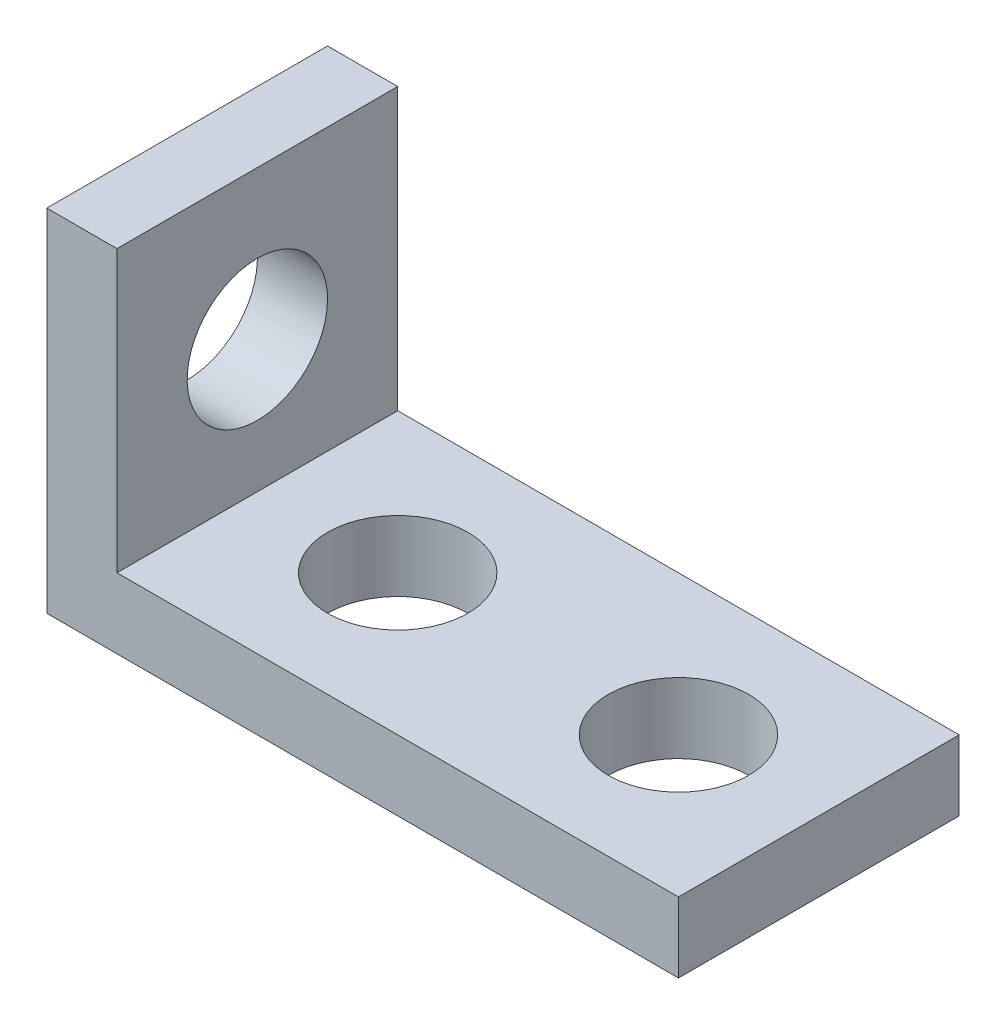
ISO-10303-21;
HEADER;
FILE_DESCRIPTION(('STEP AP214'),'2;1');
FILE_NAME('part.step','',(''),(''),'','','');
FILE_SCHEMA(('AUTOMOTIVE_DESIGN { 1 0 10303 214 1 1 1 1 }'));
ENDSEC;
DATA;
#1=APPLICATION_CONTEXT('core data for automotive mechanical design processes');
#2=APPLICATION_PROTOCOL_DEFINITION('international standard','automotive_design',2000,#1);
#3=PRODUCT_CONTEXT('',#1,'mechanical');
#4=PRODUCT('Part','Part','',(#3));
#5=PRODUCT_RELATED_PRODUCT_CATEGORY('part','',(#4));
#6=PRODUCT_DEFINITION_FORMATION('','',#4);
#7=PRODUCT_DEFINITION_CONTEXT('part definition',#1,'design');
#8=PRODUCT_DEFINITION('design','',#6,#7);
#9=PRODUCT_DEFINITION_SHAPE('','',#8);
#10=(LENGTH_UNIT() NAMED_UNIT(*) SI_UNIT(.MILLI.,.METRE.));
#11=(NAMED_UNIT(*) PLANE_ANGLE_UNIT() SI_UNIT($,.RADIAN.));
#12=(NAMED_UNIT(*) SI_UNIT($,.STERADIAN.) SOLID_ANGLE_UNIT());
#13=UNCERTAINTY_MEASURE_WITH_UNIT(LENGTH_MEASURE(1.E-05),#10,'distance_accuracy_value','');
#14=(GEOMETRIC_REPRESENTATION_CONTEXT(3) GLOBAL_UNCERTAINTY_ASSIGNED_CONTEXT((#13)) GLOBAL_UNIT_ASSIGNED_CONTEXT((#10,
#11,#12)) REPRESENTATION_CONTEXT('',''));
#15=CARTESIAN_POINT('',(0.,0.,0.));
#16=DIRECTION('',(0.,0.,1.));
#17=DIRECTION('',(1.,0.,0.));
#18=AXIS2_PLACEMENT_3D('',#15,#16,#17);
#19=CARTESIAN_POINT('',(28.575,0.,12.7));
#20=DIRECTION('',(0.,1.,0.));
#21=DIRECTION('',(-1.,0.,0.));
#22=AXIS2_PLACEMENT_3D('',#19,#20,#21);
#23=PLANE('',#22);
#24=CARTESIAN_POINT('',(22.225,0.,6.35));
#25=DIRECTION('',(0.,1.,0.));
#26=DIRECTION('',(-1.,0.,0.));
#27=AXIS2_PLACEMENT_3D('',#24,#25,#26);
#28=CIRCLE('',#27,3.175);
#29=CARTESIAN_POINT('',(19.05,0.,6.35));
#30=VERTEX_POINT('',#29);
#31=EDGE_CURVE('E164',#30,#30,#28,.T.);
#32=ORIENTED_EDGE('',*,*,#31,.T.);
#33=EDGE_LOOP('',(#32));
#34=FACE_BOUND('',#33,.T.);
#35=CARTESIAN_POINT('',(9.525,0.,6.35));
#36=DIRECTION('',(0.,1.,0.));
#37=DIRECTION('',(-1.,0.,0.));
#38=AXIS2_PLACEMENT_3D('',#35,#36,#37);
#39=CIRCLE('',#38,3.175);
#40=CARTESIAN_POINT('',(6.35,0.,6.35));
#41=VERTEX_POINT('',#40);
#42=EDGE_CURVE('E123',#41,#41,#39,.T.);
#43=ORIENTED_EDGE('',*,*,#42,.T.);
#44=EDGE_LOOP('',(#43));
#45=FACE_BOUND('',#44,.T.);
#46=DIRECTION('',(1.,0.,0.));
#47=VECTOR('',#46,1.);
#48=CARTESIAN_POINT('',(28.575,0.,0.));
#49=LINE('',#48,#47);
#50=CARTESIAN_POINT('',(0.,0.,0.));
#51=VERTEX_POINT('',#50);
#52=CARTESIAN_POINT('',(28.575,0.,0.));
#53=VERTEX_POINT('',#52);
#54=EDGE_CURVE('E119',#51,#53,#49,.T.);
#55=ORIENTED_EDGE('',*,*,#54,.T.);
#56=DIRECTION('',(0.,0.,-1.));
#57=VECTOR('',#56,1.);
#58=CARTESIAN_POINT('',(28.575,0.,12.7));
#59=LINE('',#58,#57);
#60=CARTESIAN_POINT('',(28.575,0.,12.7));
#61=VERTEX_POINT('',#60);
#62=EDGE_CURVE('E11',#61,#53,#59,.T.);
#63=ORIENTED_EDGE('',*,*,#62,.F.);
#64=DIRECTION('',(1.,0.,0.));
#65=VECTOR('',#64,1.);
#66=CARTESIAN_POINT('',(28.575,0.,12.7));
#67=LINE('',#66,#65);
#68=CARTESIAN_POINT('',(0.,0.,12.7));
#69=VERTEX_POINT('',#68);
#70=EDGE_CURVE('E130',#69,#61,#67,.T.);
#71=ORIENTED_EDGE('',*,*,#70,.F.);
#72=DIRECTION('',(0.,0.,-1.));
#73=VECTOR('',#72,1.);
#74=CARTESIAN_POINT('',(0.,0.,12.7));
#75=LINE('',#74,#73);
#76=EDGE_CURVE('E115',#69,#51,#75,.T.);
#77=ORIENTED_EDGE('',*,*,#76,.T.);
#78=EDGE_LOOP('',(#55,#63,#71,#77));
#79=FACE_BOUND('',#78,.T.);
#80=ADVANCED_FACE('F35',(#34,#45,#79),#23,.F.);
#81=CARTESIAN_POINT('',(28.575,3.175,12.7));
#82=DIRECTION('',(-1.,0.,0.));
#83=DIRECTION('',(0.,0.,1.));
#84=AXIS2_PLACEMENT_3D('',#81,#82,#83);
#85=PLANE('',#84);
#86=DIRECTION('',(0.,1.,0.));
#87=VECTOR('',#86,1.);
#88=CARTESIAN_POINT('',(28.575,3.175,0.));
#89=LINE('',#88,#87);
#90=CARTESIAN_POINT('',(28.575,3.175,0.));
#91=VERTEX_POINT('',#90);
#92=EDGE_CURVE('E122',#53,#91,#89,.T.);
#93=ORIENTED_EDGE('',*,*,#92,.T.);
#94=DIRECTION('',(0.,0.,-1.));
#95=VECTOR('',#94,1.);
#96=CARTESIAN_POINT('',(28.575,3.175,12.7));
#97=LINE('',#96,#95);
#98=CARTESIAN_POINT('',(28.575,3.175,12.7));
#99=VERTEX_POINT('',#98);
#100=EDGE_CURVE('E43',#99,#91,#97,.T.);
#101=ORIENTED_EDGE('',*,*,#100,.F.);
#102=DIRECTION('',(0.,1.,0.));
#103=VECTOR('',#102,1.);
#104=CARTESIAN_POINT('',(28.575,3.175,12.7));
#105=LINE('',#104,#103);
#106=EDGE_CURVE('E88',#61,#99,#105,.T.);
#107=ORIENTED_EDGE('',*,*,#106,.F.);
#108=ORIENTED_EDGE('',*,*,#62,.T.);
#109=EDGE_LOOP('',(#93,#101,#107,#108));
#110=FACE_BOUND('',#109,.T.);
#111=ADVANCED_FACE('F156',(#110),#85,.F.);
#112=CARTESIAN_POINT('',(3.175,3.175,12.7));
#113=DIRECTION('',(0.,-1.,0.));
#114=DIRECTION('',(1.,0.,0.));
#115=AXIS2_PLACEMENT_3D('',#112,#113,#114);
#116=PLANE('',#115);
#117=CARTESIAN_POINT('',(22.225,3.175,6.35));
#118=DIRECTION('',(0.,1.,0.));
#119=DIRECTION('',(-1.,0.,0.));
#120=AXIS2_PLACEMENT_3D('',#117,#118,#119);
#121=CIRCLE('',#120,3.175);
#122=CARTESIAN_POINT('',(19.05,3.175,6.35));
#123=VERTEX_POINT('',#122);
#124=EDGE_CURVE('E173',#123,#123,#121,.T.);
#125=ORIENTED_EDGE('',*,*,#124,.F.);
#126=EDGE_LOOP('',(#125));
#127=FACE_BOUND('',#126,.T.);
#128=CARTESIAN_POINT('',(9.525,3.175,6.35));
#129=DIRECTION('',(0.,1.,0.));
#130=DIRECTION('',(-1.,0.,0.));
#131=AXIS2_PLACEMENT_3D('',#128,#129,#130);
#132=CIRCLE('',#131,3.175);
#133=CARTESIAN_POINT('',(6.35,3.175,6.35));
#134=VERTEX_POINT('',#133);
#135=EDGE_CURVE('E168',#134,#134,#132,.T.);
#136=ORIENTED_EDGE('',*,*,#135,.F.);
#137=EDGE_LOOP('',(#136));
#138=FACE_BOUND('',#137,.T.);
#139=DIRECTION('',(-1.,0.,0.));
#140=VECTOR('',#139,1.);
#141=CARTESIAN_POINT('',(3.175,3.175,0.));
#142=LINE('',#141,#140);
#143=CARTESIAN_POINT('',(3.175,3.175,0.));
#144=VERTEX_POINT('',#143);
#145=EDGE_CURVE('E125',#91,#144,#142,.T.);
#146=ORIENTED_EDGE('',*,*,#145,.T.);
#147=DIRECTION('',(0.,0.,-1.));
#148=VECTOR('',#147,1.);
#149=CARTESIAN_POINT('',(3.175,3.175,12.7));
#150=LINE('',#149,#148);
#151=CARTESIAN_POINT('',(3.175,3.175,12.7));
#152=VERTEX_POINT('',#151);
#153=EDGE_CURVE('E110',#152,#144,#150,.T.);
#154=ORIENTED_EDGE('',*,*,#153,.F.);
#155=DIRECTION('',(-1.,0.,0.));
#156=VECTOR('',#155,1.);
#157=CARTESIAN_POINT('',(3.175,3.175,12.7));
#158=LINE('',#157,#156);
#159=EDGE_CURVE('E101',#99,#152,#158,.T.);
#160=ORIENTED_EDGE('',*,*,#159,.F.);
#161=ORIENTED_EDGE('',*,*,#100,.T.);
#162=EDGE_LOOP('',(#146,#154,#160,#161));
#163=FACE_BOUND('',#162,.T.);
#164=ADVANCED_FACE('F136',(#127,#138,#163),#116,.F.);
#165=CARTESIAN_POINT('',(3.175,15.875,12.7));
#166=DIRECTION('',(-1.,0.,0.));
#167=DIRECTION('',(0.,-1.,0.));
#168=AXIS2_PLACEMENT_3D('',#165,#166,#167);
#169=PLANE('',#168);
#170=CARTESIAN_POINT('',(3.175,9.144,6.35));
#171=DIRECTION('',(1.,0.,0.));
#172=DIRECTION('',(0.,1.,0.));
#173=AXIS2_PLACEMENT_3D('',#170,#171,#172);
#174=CIRCLE('',#173,3.175);
#175=CARTESIAN_POINT('',(3.175,12.319,6.35));
#176=VERTEX_POINT('',#175);
#177=EDGE_CURVE('E180',#176,#176,#174,.T.);
#178=ORIENTED_EDGE('',*,*,#177,.F.);
#179=EDGE_LOOP('',(#178));
#180=FACE_BOUND('',#179,.T.);
#181=DIRECTION('',(0.,1.,0.));
#182=VECTOR('',#181,1.);
#183=CARTESIAN_POINT('',(3.175,15.875,0.));
#184=LINE('',#183,#182);
#185=CARTESIAN_POINT('',(3.175,15.875,0.));
#186=VERTEX_POINT('',#185);
#187=EDGE_CURVE('E109',#144,#186,#184,.T.);
#188=ORIENTED_EDGE('',*,*,#187,.T.);
#189=DIRECTION('',(0.,0.,-1.));
#190=VECTOR('',#189,1.);
#191=CARTESIAN_POINT('',(3.175,15.875,12.7));
#192=LINE('',#191,#190);
#193=CARTESIAN_POINT('',(3.175,15.875,12.7));
#194=VERTEX_POINT('',#193);
#195=EDGE_CURVE('E106',#194,#186,#192,.T.);
#196=ORIENTED_EDGE('',*,*,#195,.F.);
#197=DIRECTION('',(0.,1.,0.));
#198=VECTOR('',#197,1.);
#199=CARTESIAN_POINT('',(3.175,15.875,12.7));
#200=LINE('',#199,#198);
#201=EDGE_CURVE('E95',#152,#194,#200,.T.);
#202=ORIENTED_EDGE('',*,*,#201,.F.);
#203=ORIENTED_EDGE('',*,*,#153,.T.);
#204=EDGE_LOOP('',(#188,#196,#202,#203));
#205=FACE_BOUND('',#204,.T.);
#206=ADVANCED_FACE('F107',(#180,#205),#169,.F.);
#207=CARTESIAN_POINT('',(0.,15.875,12.7));
#208=DIRECTION('',(0.,-1.,0.));
#209=DIRECTION('',(0.,0.,-1.));
#210=AXIS2_PLACEMENT_3D('',#207,#208,#209);
#211=PLANE('',#210);
#212=DIRECTION('',(-1.,0.,0.));
#213=VECTOR('',#212,1.);
#214=CARTESIAN_POINT('',(0.,15.875,0.));
#215=LINE('',#214,#213);
#216=CARTESIAN_POINT('',(0.,15.875,0.));
#217=VERTEX_POINT('',#216);
#218=EDGE_CURVE('E74',#186,#217,#215,.T.);
#219=ORIENTED_EDGE('',*,*,#218,.T.);
#220=DIRECTION('',(0.,0.,-1.));
#221=VECTOR('',#220,1.);
#222=CARTESIAN_POINT('',(0.,15.875,12.7));
#223=LINE('',#222,#221);
#224=CARTESIAN_POINT('',(0.,15.875,12.7));
#225=VERTEX_POINT('',#224);
#226=EDGE_CURVE('E111',#225,#217,#223,.T.);
#227=ORIENTED_EDGE('',*,*,#226,.F.);
#228=DIRECTION('',(-1.,0.,0.));
#229=VECTOR('',#228,1.);
#230=CARTESIAN_POINT('',(0.,15.875,12.7));
#231=LINE('',#230,#229);
#232=EDGE_CURVE('E99',#194,#225,#231,.T.);
#233=ORIENTED_EDGE('',*,*,#232,.F.);
#234=ORIENTED_EDGE('',*,*,#195,.T.);
#235=EDGE_LOOP('',(#219,#227,#233,#234));
#236=FACE_BOUND('',#235,.T.);
#237=ADVANCED_FACE('F113',(#236),#211,.F.);
#238=CARTESIAN_POINT('',(0.,0.,12.7));
#239=DIRECTION('',(1.,0.,0.));
#240=DIRECTION('',(0.,0.,-1.));
#241=AXIS2_PLACEMENT_3D('',#238,#239,#240);
#242=PLANE('',#241);
#243=CARTESIAN_POINT('',(0.,9.144,6.35));
#244=DIRECTION('',(1.,0.,0.));
#245=DIRECTION('',(0.,1.,0.));
#246=AXIS2_PLACEMENT_3D('',#243,#244,#245);
#247=CIRCLE('',#246,3.175);
#248=CARTESIAN_POINT('',(0.,12.319,6.35));
#249=VERTEX_POINT('',#248);
#250=EDGE_CURVE('E178',#249,#249,#247,.T.);
#251=ORIENTED_EDGE('',*,*,#250,.T.);
#252=EDGE_LOOP('',(#251));
#253=FACE_BOUND('',#252,.T.);
#254=DIRECTION('',(0.,-1.,0.));
#255=VECTOR('',#254,1.);
#256=CARTESIAN_POINT('',(0.,0.,0.));
#257=LINE('',#256,#255);
#258=EDGE_CURVE('E80',#217,#51,#257,.T.);
#259=ORIENTED_EDGE('',*,*,#258,.T.);
#260=ORIENTED_EDGE('',*,*,#76,.F.);
#261=DIRECTION('',(0.,-1.,0.));
#262=VECTOR('',#261,1.);
#263=CARTESIAN_POINT('',(0.,0.,12.7));
#264=LINE('',#263,#262);
#265=EDGE_CURVE('E51',#225,#69,#264,.T.);
#266=ORIENTED_EDGE('',*,*,#265,.F.);
#267=ORIENTED_EDGE('',*,*,#226,.T.);
#268=EDGE_LOOP('',(#259,#260,#266,#267));
#269=FACE_BOUND('',#268,.T.);
#270=ADVANCED_FACE('F143',(#253,#269),#242,.F.);
#271=CARTESIAN_POINT('',(0.,0.,12.7));
#272=DIRECTION('',(0.,0.,-1.));
#273=DIRECTION('',(-1.,0.,0.));
#274=AXIS2_PLACEMENT_3D('',#271,#272,#273);
#275=PLANE('',#274);
#276=ORIENTED_EDGE('',*,*,#70,.T.);
#277=ORIENTED_EDGE('',*,*,#106,.T.);
#278=ORIENTED_EDGE('',*,*,#159,.T.);
#279=ORIENTED_EDGE('',*,*,#201,.T.);
#280=ORIENTED_EDGE('',*,*,#232,.T.);
#281=ORIENTED_EDGE('',*,*,#265,.T.);
#282=EDGE_LOOP('',(#276,#277,#278,#279,#280,#281));
#283=FACE_BOUND('',#282,.T.);
#284=ADVANCED_FACE('F97',(#283),#275,.F.);
#285=CARTESIAN_POINT('',(0.,0.,0.));
#286=DIRECTION('',(0.,0.,-1.));
#287=DIRECTION('',(-1.,0.,0.));
#288=AXIS2_PLACEMENT_3D('',#285,#286,#287);
#289=PLANE('',#288);
#290=ORIENTED_EDGE('',*,*,#54,.F.);
#291=ORIENTED_EDGE('',*,*,#258,.F.);
#292=ORIENTED_EDGE('',*,*,#218,.F.);
#293=ORIENTED_EDGE('',*,*,#187,.F.);
#294=ORIENTED_EDGE('',*,*,#145,.F.);
#295=ORIENTED_EDGE('',*,*,#92,.F.);
#296=EDGE_LOOP('',(#290,#291,#292,#293,#294,#295));
#297=FACE_BOUND('',#296,.T.);
#298=ADVANCED_FACE('F139',(#297),#289,.T.);
#299=CARTESIAN_POINT('',(9.525,0.,6.35));
#300=DIRECTION('',(0.,1.,0.));
#301=DIRECTION('',(-1.,0.,0.));
#302=AXIS2_PLACEMENT_3D('',#299,#300,#301);
#303=CYLINDRICAL_SURFACE('',#302,3.175);
#304=ORIENTED_EDGE('',*,*,#42,.F.);
#305=EDGE_LOOP('',(#304));
#306=FACE_BOUND('',#305,.T.);
#307=ORIENTED_EDGE('',*,*,#135,.T.);
#308=EDGE_LOOP('',(#307));
#309=FACE_BOUND('',#308,.T.);
#310=ADVANCED_FACE('F205',(#306,#309),#303,.F.);
#311=CARTESIAN_POINT('',(22.225,0.,6.35));
#312=DIRECTION('',(0.,1.,0.));
#313=DIRECTION('',(-1.,0.,0.));
#314=AXIS2_PLACEMENT_3D('',#311,#312,#313);
#315=CYLINDRICAL_SURFACE('',#314,3.175);
#316=ORIENTED_EDGE('',*,*,#31,.F.);
#317=EDGE_LOOP('',(#316));
#318=FACE_BOUND('',#317,.T.);
#319=ORIENTED_EDGE('',*,*,#124,.T.);
#320=EDGE_LOOP('',(#319));
#321=FACE_BOUND('',#320,.T.);
#322=ADVANCED_FACE('F188',(#318,#321),#315,.F.);
#323=CARTESIAN_POINT('',(0.,9.144,6.35));
#324=DIRECTION('',(1.,0.,0.));
#325=DIRECTION('',(0.,1.,0.));
#326=AXIS2_PLACEMENT_3D('',#323,#324,#325);
#327=CYLINDRICAL_SURFACE('',#326,3.175);
#328=ORIENTED_EDGE('',*,*,#250,.F.);
#329=EDGE_LOOP('',(#328));
#330=FACE_BOUND('',#329,.T.);
#331=ORIENTED_EDGE('',*,*,#177,.T.);
#332=EDGE_LOOP('',(#331));
#333=FACE_BOUND('',#332,.T.);
#334=ADVANCED_FACE('F185',(#330,#333),#327,.F.);
#335=CLOSED_SHELL('',(#80,#111,#164,#206,#237,#270,#284,#298,#310,#322,#334));
#336=MANIFOLD_SOLID_BREP('B2',#335);
#337=ADVANCED_BREP_SHAPE_REPRESENTATION('',(#18,#336),#14);
#338=SHAPE_DEFINITION_REPRESENTATION(#9,#337);
ENDSEC;
END-ISO-10303-21;
